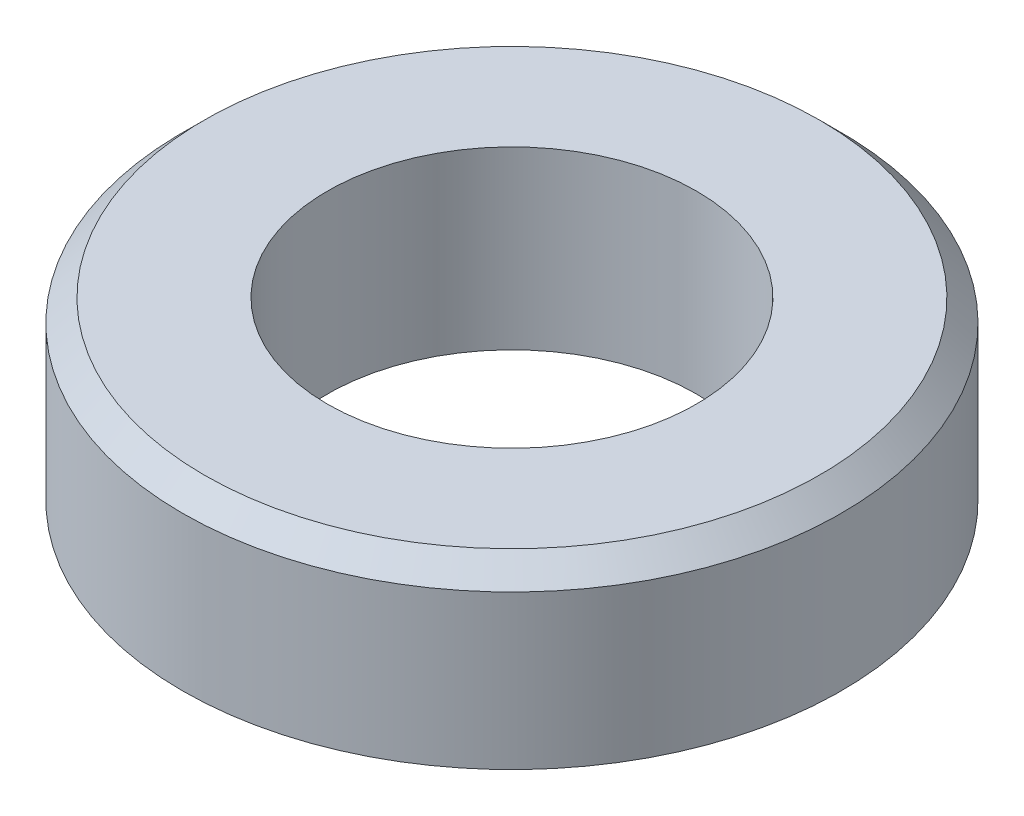
ISO-10303-21;
HEADER;
FILE_DESCRIPTION(('STEP AP214'),'2;1');
FILE_NAME('part.step','',(''),(''),'','','');
FILE_SCHEMA(('AUTOMOTIVE_DESIGN { 1 0 10303 214 1 1 1 1 }'));
ENDSEC;
DATA;
#1=APPLICATION_CONTEXT('core data for automotive mechanical design processes');
#2=APPLICATION_PROTOCOL_DEFINITION('international standard','automotive_design',2000,#1);
#3=PRODUCT_CONTEXT('',#1,'mechanical');
#4=PRODUCT('Part','Part','',(#3));
#5=PRODUCT_RELATED_PRODUCT_CATEGORY('part','',(#4));
#6=PRODUCT_DEFINITION_FORMATION('','',#4);
#7=PRODUCT_DEFINITION_CONTEXT('part definition',#1,'design');
#8=PRODUCT_DEFINITION('design','',#6,#7);
#9=PRODUCT_DEFINITION_SHAPE('','',#8);
#10=(LENGTH_UNIT() NAMED_UNIT(*) SI_UNIT(.MILLI.,.METRE.));
#11=(NAMED_UNIT(*) PLANE_ANGLE_UNIT() SI_UNIT($,.RADIAN.));
#12=(NAMED_UNIT(*) SI_UNIT($,.STERADIAN.) SOLID_ANGLE_UNIT());
#13=UNCERTAINTY_MEASURE_WITH_UNIT(LENGTH_MEASURE(1.E-05),#10,'distance_accuracy_value','');
#14=(GEOMETRIC_REPRESENTATION_CONTEXT(3) GLOBAL_UNCERTAINTY_ASSIGNED_CONTEXT((#13)) GLOBAL_UNIT_ASSIGNED_CONTEXT((#10,
#11,#12)) REPRESENTATION_CONTEXT('',''));
#15=CARTESIAN_POINT('',(0.,0.,0.));
#16=DIRECTION('',(0.,0.,1.));
#17=DIRECTION('',(1.,0.,0.));
#18=AXIS2_PLACEMENT_3D('',#15,#16,#17);
#19=CARTESIAN_POINT('',(0.,4.,0.));
#20=DIRECTION('',(0.,1.,0.));
#21=DIRECTION('',(0.,0.,1.));
#22=AXIS2_PLACEMENT_3D('',#19,#20,#21);
#23=PLANE('',#22);
#24=CARTESIAN_POINT('',(0.,4.,0.));
#25=DIRECTION('',(0.,1.,0.));
#26=DIRECTION('',(0.,0.,1.));
#27=AXIS2_PLACEMENT_3D('',#24,#25,#26);
#28=CIRCLE('',#27,7.);
#29=CARTESIAN_POINT('',(0.,4.,7.));
#30=VERTEX_POINT('',#29);
#31=EDGE_CURVE('E41',#30,#30,#28,.T.);
#32=ORIENTED_EDGE('',*,*,#31,.T.);
#33=EDGE_LOOP('',(#32));
#34=FACE_BOUND('',#33,.T.);
#35=CARTESIAN_POINT('',(0.,4.,0.));
#36=DIRECTION('',(0.,1.,0.));
#37=DIRECTION('',(0.,0.,1.));
#38=AXIS2_PLACEMENT_3D('',#35,#36,#37);
#39=CIRCLE('',#38,4.2);
#40=CARTESIAN_POINT('',(0.,4.,4.2));
#41=VERTEX_POINT('',#40);
#42=EDGE_CURVE('E49',#41,#41,#39,.T.);
#43=ORIENTED_EDGE('',*,*,#42,.F.);
#44=EDGE_LOOP('',(#43));
#45=FACE_BOUND('',#44,.T.);
#46=ADVANCED_FACE('F33',(#34,#45),#23,.T.);
#47=CARTESIAN_POINT('',(0.,0.,0.));
#48=DIRECTION('',(0.,1.,0.));
#49=DIRECTION('',(0.,0.,1.));
#50=AXIS2_PLACEMENT_3D('',#47,#48,#49);
#51=PLANE('',#50);
#52=CARTESIAN_POINT('',(0.,0.,0.));
#53=DIRECTION('',(0.,1.,0.));
#54=DIRECTION('',(0.,0.,1.));
#55=AXIS2_PLACEMENT_3D('',#52,#53,#54);
#56=CIRCLE('',#55,7.5);
#57=CARTESIAN_POINT('',(0.,0.,7.5));
#58=VERTEX_POINT('',#57);
#59=EDGE_CURVE('E45',#58,#58,#56,.T.);
#60=ORIENTED_EDGE('',*,*,#59,.F.);
#61=EDGE_LOOP('',(#60));
#62=FACE_BOUND('',#61,.T.);
#63=CARTESIAN_POINT('',(0.,0.,0.));
#64=DIRECTION('',(0.,1.,0.));
#65=DIRECTION('',(0.,0.,1.));
#66=AXIS2_PLACEMENT_3D('',#63,#64,#65);
#67=CIRCLE('',#66,4.2);
#68=CARTESIAN_POINT('',(0.,0.,4.2));
#69=VERTEX_POINT('',#68);
#70=EDGE_CURVE('E52',#69,#69,#67,.T.);
#71=ORIENTED_EDGE('',*,*,#70,.T.);
#72=EDGE_LOOP('',(#71));
#73=FACE_BOUND('',#72,.T.);
#74=ADVANCED_FACE('F62',(#62,#73),#51,.F.);
#75=CARTESIAN_POINT('',(0.,4.,0.));
#76=DIRECTION('',(0.,-1.,0.));
#77=DIRECTION('',(0.,0.,-1.));
#78=AXIS2_PLACEMENT_3D('',#75,#76,#77);
#79=CYLINDRICAL_SURFACE('',#78,7.5);
#80=CARTESIAN_POINT('',(0.,3.5,0.));
#81=DIRECTION('',(0.,1.,0.));
#82=DIRECTION('',(0.,0.,1.));
#83=AXIS2_PLACEMENT_3D('',#80,#81,#82);
#84=CIRCLE('',#83,7.5);
#85=CARTESIAN_POINT('',(0.,3.5,7.5));
#86=VERTEX_POINT('',#85);
#87=EDGE_CURVE('E10',#86,#86,#84,.F.);
#88=ORIENTED_EDGE('',*,*,#87,.T.);
#89=EDGE_LOOP('',(#88));
#90=FACE_BOUND('',#89,.T.);
#91=ORIENTED_EDGE('',*,*,#59,.T.);
#92=EDGE_LOOP('',(#91));
#93=FACE_BOUND('',#92,.T.);
#94=ADVANCED_FACE('F67',(#90,#93),#79,.T.);
#95=CARTESIAN_POINT('',(0.,4.,0.));
#96=DIRECTION('',(0.,-1.,0.));
#97=DIRECTION('',(0.,0.,-1.));
#98=AXIS2_PLACEMENT_3D('',#95,#96,#97);
#99=CYLINDRICAL_SURFACE('',#98,4.2);
#100=ORIENTED_EDGE('',*,*,#42,.T.);
#101=EDGE_LOOP('',(#100));
#102=FACE_BOUND('',#101,.T.);
#103=ORIENTED_EDGE('',*,*,#70,.F.);
#104=EDGE_LOOP('',(#103));
#105=FACE_BOUND('',#104,.T.);
#106=ADVANCED_FACE('F58',(#102,#105),#99,.F.);
#107=CARTESIAN_POINT('',(0.,4.,0.));
#108=DIRECTION('',(0.,-1.,0.));
#109=DIRECTION('',(0.,0.,-1.));
#110=AXIS2_PLACEMENT_3D('',#107,#108,#109);
#111=CONICAL_SURFACE('',#110,7.,0.785398163397447);
#112=ORIENTED_EDGE('',*,*,#87,.F.);
#113=EDGE_LOOP('',(#112));
#114=FACE_BOUND('',#113,.T.);
#115=ORIENTED_EDGE('',*,*,#31,.F.);
#116=EDGE_LOOP('',(#115));
#117=FACE_BOUND('',#116,.T.);
#118=ADVANCED_FACE('F36',(#114,#117),#111,.T.);
#119=CLOSED_SHELL('',(#46,#74,#94,#106,#118));
#120=MANIFOLD_SOLID_BREP('B2',#119);
#121=ADVANCED_BREP_SHAPE_REPRESENTATION('',(#18,#120),#14);
#122=SHAPE_DEFINITION_REPRESENTATION(#9,#121);
ENDSEC;
END-ISO-10303-21;
